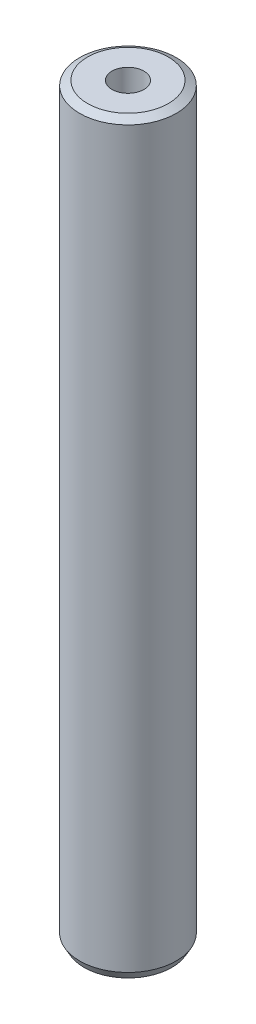
ISO-10303-21;
HEADER;
FILE_DESCRIPTION(('STEP AP214'),'2;1');
FILE_NAME('part.step','',(''),(''),'','','');
FILE_SCHEMA(('AUTOMOTIVE_DESIGN { 1 0 10303 214 1 1 1 1 }'));
ENDSEC;
DATA;
#1=APPLICATION_CONTEXT('core data for automotive mechanical design processes');
#2=APPLICATION_PROTOCOL_DEFINITION('international standard','automotive_design',2000,#1);
#3=PRODUCT_CONTEXT('',#1,'mechanical');
#4=PRODUCT('Part','Part','',(#3));
#5=PRODUCT_RELATED_PRODUCT_CATEGORY('part','',(#4));
#6=PRODUCT_DEFINITION_FORMATION('','',#4);
#7=PRODUCT_DEFINITION_CONTEXT('part definition',#1,'design');
#8=PRODUCT_DEFINITION('design','',#6,#7);
#9=PRODUCT_DEFINITION_SHAPE('','',#8);
#10=(LENGTH_UNIT() NAMED_UNIT(*) SI_UNIT(.MILLI.,.METRE.));
#11=(NAMED_UNIT(*) PLANE_ANGLE_UNIT() SI_UNIT($,.RADIAN.));
#12=(NAMED_UNIT(*) SI_UNIT($,.STERADIAN.) SOLID_ANGLE_UNIT());
#13=UNCERTAINTY_MEASURE_WITH_UNIT(LENGTH_MEASURE(1.E-05),#10,'distance_accuracy_value','');
#14=(GEOMETRIC_REPRESENTATION_CONTEXT(3) GLOBAL_UNCERTAINTY_ASSIGNED_CONTEXT((#13)) GLOBAL_UNIT_ASSIGNED_CONTEXT((#10,
#11,#12)) REPRESENTATION_CONTEXT('',''));
#15=CARTESIAN_POINT('',(0.,0.,0.));
#16=DIRECTION('',(0.,0.,1.));
#17=DIRECTION('',(1.,0.,0.));
#18=AXIS2_PLACEMENT_3D('',#15,#16,#17);
#19=CARTESIAN_POINT('',(0.,540.355789633325,0.));
#20=DIRECTION('',(0.,-1.,0.));
#21=DIRECTION('',(0.,0.,-1.));
#22=AXIS2_PLACEMENT_3D('',#19,#20,#21);
#23=CYLINDRICAL_SURFACE('',#22,35.);
#24=CARTESIAN_POINT('',(0.,537.099503149682,0.));
#25=DIRECTION('',(0.,1.,0.));
#26=DIRECTION('',(0.,0.,1.));
#27=AXIS2_PLACEMENT_3D('',#24,#25,#26);
#28=CIRCLE('',#27,35.);
#29=CARTESIAN_POINT('',(0.,537.099503149682,35.));
#30=VERTEX_POINT('',#29);
#31=EDGE_CURVE('E50',#30,#30,#28,.F.);
#32=ORIENTED_EDGE('',*,*,#31,.T.);
#33=EDGE_LOOP('',(#32));
#34=FACE_BOUND('',#33,.T.);
#35=CARTESIAN_POINT('',(0.,5.77063915618237,0.));
#36=DIRECTION('',(0.,1.,0.));
#37=DIRECTION('',(0.,0.,1.));
#38=AXIS2_PLACEMENT_3D('',#35,#36,#37);
#39=CIRCLE('',#38,35.);
#40=CARTESIAN_POINT('',(0.,5.77063915618237,35.));
#41=VERTEX_POINT('',#40);
#42=EDGE_CURVE('E51',#41,#41,#39,.T.);
#43=ORIENTED_EDGE('',*,*,#42,.T.);
#44=EDGE_LOOP('',(#43));
#45=FACE_BOUND('',#44,.T.);
#46=ADVANCED_FACE('F39',(#34,#45),#23,.T.);
#47=CARTESIAN_POINT('',(0.,540.355789633325,0.));
#48=DIRECTION('',(0.,1.,0.));
#49=DIRECTION('',(0.,0.,1.));
#50=AXIS2_PLACEMENT_3D('',#47,#48,#49);
#51=PLANE('',#50);
#52=CARTESIAN_POINT('',(0.,540.355789633325,0.));
#53=DIRECTION('',(0.,1.,0.));
#54=DIRECTION('',(0.,0.,1.));
#55=AXIS2_PLACEMENT_3D('',#52,#53,#54);
#56=CIRCLE('',#55,29.2293608438173);
#57=CARTESIAN_POINT('',(0.,540.355789633325,29.2293608438173));
#58=VERTEX_POINT('',#57);
#59=EDGE_CURVE('E54',#58,#58,#56,.T.);
#60=ORIENTED_EDGE('',*,*,#59,.T.);
#61=EDGE_LOOP('',(#60));
#62=FACE_BOUND('',#61,.T.);
#63=CARTESIAN_POINT('',(0.,540.355789633325,0.));
#64=DIRECTION('',(0.,1.,0.));
#65=DIRECTION('',(0.,0.,1.));
#66=AXIS2_PLACEMENT_3D('',#63,#64,#65);
#67=CIRCLE('',#66,11.5556308828524);
#68=CARTESIAN_POINT('',(0.,540.355789633325,11.5556308828524));
#69=VERTEX_POINT('',#68);
#70=EDGE_CURVE('E58',#69,#69,#67,.T.);
#71=ORIENTED_EDGE('',*,*,#70,.F.);
#72=EDGE_LOOP('',(#71));
#73=FACE_BOUND('',#72,.T.);
#74=ADVANCED_FACE('F69',(#62,#73),#51,.T.);
#75=CARTESIAN_POINT('',(0.,0.,0.));
#76=DIRECTION('',(0.,1.,0.));
#77=DIRECTION('',(0.,0.,1.));
#78=AXIS2_PLACEMENT_3D('',#75,#76,#77);
#79=PLANE('',#78);
#80=CARTESIAN_POINT('',(0.,0.,0.));
#81=DIRECTION('',(0.,1.,0.));
#82=DIRECTION('',(0.,0.,1.));
#83=AXIS2_PLACEMENT_3D('',#80,#81,#82);
#84=CIRCLE('',#83,31.7437135163571);
#85=CARTESIAN_POINT('',(0.,0.,31.7437135163571));
#86=VERTEX_POINT('',#85);
#87=EDGE_CURVE('E10',#86,#86,#84,.F.);
#88=ORIENTED_EDGE('',*,*,#87,.T.);
#89=EDGE_LOOP('',(#88));
#90=FACE_BOUND('',#89,.T.);
#91=CARTESIAN_POINT('',(0.,0.,0.));
#92=DIRECTION('',(0.,1.,0.));
#93=DIRECTION('',(0.,0.,1.));
#94=AXIS2_PLACEMENT_3D('',#91,#92,#93);
#95=CIRCLE('',#94,11.5556308828524);
#96=CARTESIAN_POINT('',(0.,0.,11.5556308828524));
#97=VERTEX_POINT('',#96);
#98=EDGE_CURVE('E63',#97,#97,#95,.T.);
#99=ORIENTED_EDGE('',*,*,#98,.T.);
#100=EDGE_LOOP('',(#99));
#101=FACE_BOUND('',#100,.T.);
#102=ADVANCED_FACE('F75',(#90,#101),#79,.F.);
#103=CARTESIAN_POINT('',(0.,540.355789633325,0.));
#104=DIRECTION('',(0.,-1.,0.));
#105=DIRECTION('',(0.,0.,-1.));
#106=AXIS2_PLACEMENT_3D('',#103,#104,#105);
#107=CYLINDRICAL_SURFACE('',#106,11.5556308828524);
#108=ORIENTED_EDGE('',*,*,#70,.T.);
#109=EDGE_LOOP('',(#108));
#110=FACE_BOUND('',#109,.T.);
#111=ORIENTED_EDGE('',*,*,#98,.F.);
#112=EDGE_LOOP('',(#111));
#113=FACE_BOUND('',#112,.T.);
#114=ADVANCED_FACE('F70',(#110,#113),#107,.F.);
#115=CARTESIAN_POINT('',(0.,540.355789633325,0.));
#116=DIRECTION('',(0.,-1.,0.));
#117=DIRECTION('',(0.,0.,-1.));
#118=AXIS2_PLACEMENT_3D('',#115,#116,#117);
#119=CONICAL_SURFACE('',#118,29.2293608438173,1.05705175663931);
#120=ORIENTED_EDGE('',*,*,#31,.F.);
#121=EDGE_LOOP('',(#120));
#122=FACE_BOUND('',#121,.T.);
#123=ORIENTED_EDGE('',*,*,#59,.F.);
#124=EDGE_LOOP('',(#123));
#125=FACE_BOUND('',#124,.T.);
#126=ADVANCED_FACE('F81',(#122,#125),#119,.T.);
#127=CARTESIAN_POINT('',(0.,5.77063915618237,0.));
#128=DIRECTION('',(0.,1.,0.));
#129=DIRECTION('',(0.,0.,1.));
#130=AXIS2_PLACEMENT_3D('',#127,#128,#129);
#131=CONICAL_SURFACE('',#130,35.,0.513744570155585);
#132=ORIENTED_EDGE('',*,*,#87,.F.);
#133=EDGE_LOOP('',(#132));
#134=FACE_BOUND('',#133,.T.);
#135=ORIENTED_EDGE('',*,*,#42,.F.);
#136=EDGE_LOOP('',(#135));
#137=FACE_BOUND('',#136,.T.);
#138=ADVANCED_FACE('F45',(#134,#137),#131,.T.);
#139=CLOSED_SHELL('',(#46,#74,#102,#114,#126,#138));
#140=MANIFOLD_SOLID_BREP('B2',#139);
#141=ADVANCED_BREP_SHAPE_REPRESENTATION('',(#18,#140),#14);
#142=SHAPE_DEFINITION_REPRESENTATION(#9,#141);
ENDSEC;
END-ISO-10303-21;
